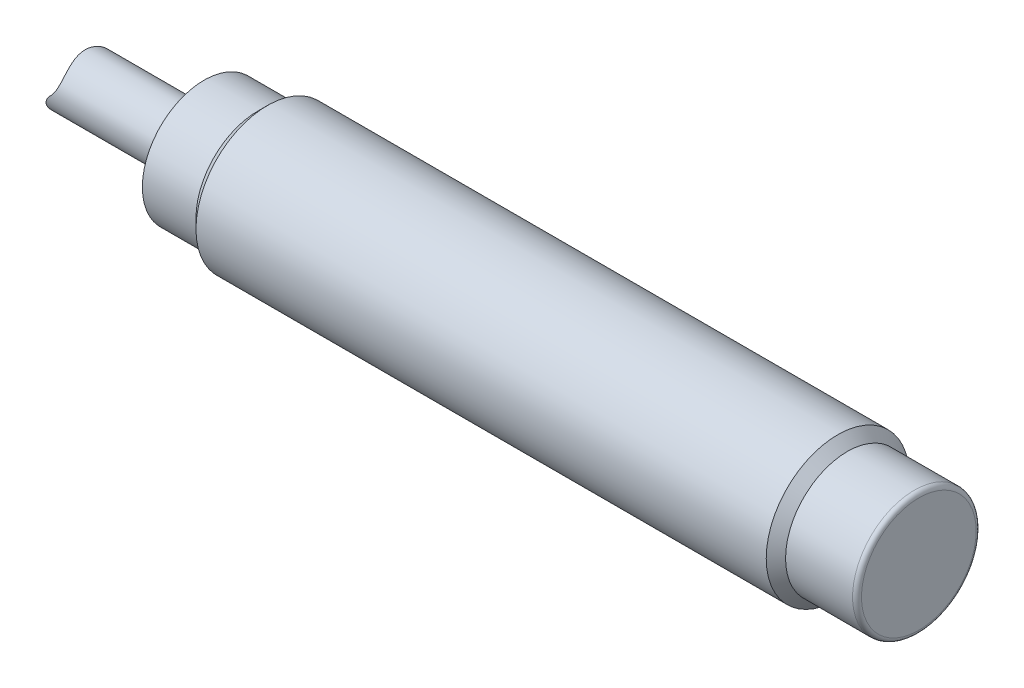
ISO-10303-21;
HEADER;
FILE_DESCRIPTION(('STEP AP214'),'2;1');
FILE_NAME('part.step','',(''),(''),'','','');
FILE_SCHEMA(('AUTOMOTIVE_DESIGN { 1 0 10303 214 1 1 1 1 }'));
ENDSEC;
DATA;
#1=APPLICATION_CONTEXT('core data for automotive mechanical design processes');
#2=APPLICATION_PROTOCOL_DEFINITION('international standard','automotive_design',2000,#1);
#3=PRODUCT_CONTEXT('',#1,'mechanical');
#4=PRODUCT('Part','Part','',(#3));
#5=PRODUCT_RELATED_PRODUCT_CATEGORY('part','',(#4));
#6=PRODUCT_DEFINITION_FORMATION('','',#4);
#7=PRODUCT_DEFINITION_CONTEXT('part definition',#1,'design');
#8=PRODUCT_DEFINITION('design','',#6,#7);
#9=PRODUCT_DEFINITION_SHAPE('','',#8);
#10=(LENGTH_UNIT() NAMED_UNIT(*) SI_UNIT(.MILLI.,.METRE.));
#11=(NAMED_UNIT(*) PLANE_ANGLE_UNIT() SI_UNIT($,.RADIAN.));
#12=(NAMED_UNIT(*) SI_UNIT($,.STERADIAN.) SOLID_ANGLE_UNIT());
#13=UNCERTAINTY_MEASURE_WITH_UNIT(LENGTH_MEASURE(1.E-05),#10,'distance_accuracy_value','');
#14=(GEOMETRIC_REPRESENTATION_CONTEXT(3) GLOBAL_UNCERTAINTY_ASSIGNED_CONTEXT((#13)) GLOBAL_UNIT_ASSIGNED_CONTEXT((#10,
#11,#12)) REPRESENTATION_CONTEXT('',''));
#15=CARTESIAN_POINT('',(0.,0.,0.));
#16=DIRECTION('',(0.,0.,1.));
#17=DIRECTION('',(1.,0.,0.));
#18=AXIS2_PLACEMENT_3D('',#15,#16,#17);
#19=CARTESIAN_POINT('',(0.,3.45875,0.));
#20=DIRECTION('',(1.,0.,0.));
#21=DIRECTION('',(0.,0.,-1.));
#22=AXIS2_PLACEMENT_3D('',#19,#20,#21);
#23=PLANE('',#22);
#24=CARTESIAN_POINT('',(0.,2.5,0.));
#25=DIRECTION('',(1.,0.,0.));
#26=DIRECTION('',(0.,0.,-1.));
#27=AXIS2_PLACEMENT_3D('',#24,#25,#26);
#28=CIRCLE('',#27,0.5);
#29=CARTESIAN_POINT('',(0.,2.5,-0.5));
#30=VERTEX_POINT('',#29);
#31=EDGE_CURVE('E19',#30,#30,#28,.T.);
#32=ORIENTED_EDGE('',*,*,#31,.T.);
#33=EDGE_LOOP('',(#32));
#34=FACE_BOUND('',#33,.T.);
#35=CARTESIAN_POINT('',(0.,0.,0.));
#36=DIRECTION('',(1.,0.,0.));
#37=DIRECTION('',(0.,0.,-1.));
#38=AXIS2_PLACEMENT_3D('',#35,#36,#37);
#39=CIRCLE('',#38,1.6);
#40=CARTESIAN_POINT('',(0.,0.,-1.6));
#41=VERTEX_POINT('',#40);
#42=EDGE_CURVE('E49',#41,#41,#39,.T.);
#43=ORIENTED_EDGE('',*,*,#42,.T.);
#44=EDGE_LOOP('',(#43));
#45=FACE_BOUND('',#44,.T.);
#46=CARTESIAN_POINT('',(0.,0.,0.));
#47=DIRECTION('',(-1.,0.,0.));
#48=DIRECTION('',(0.,0.,1.));
#49=AXIS2_PLACEMENT_3D('',#46,#47,#48);
#50=CIRCLE('',#49,3.45875);
#51=CARTESIAN_POINT('',(0.,0.,3.45875));
#52=VERTEX_POINT('',#51);
#53=EDGE_CURVE('E97',#52,#52,#50,.T.);
#54=ORIENTED_EDGE('',*,*,#53,.T.);
#55=EDGE_LOOP('',(#54));
#56=FACE_BOUND('',#55,.T.);
#57=ADVANCED_FACE('F16',(#34,#45,#56),#23,.F.);
#58=CARTESIAN_POINT('',(36.,0.,0.));
#59=DIRECTION('',(-1.,0.,0.));
#60=DIRECTION('',(0.,0.,1.));
#61=AXIS2_PLACEMENT_3D('',#58,#59,#60);
#62=CONICAL_SURFACE('',#61,3.45875,0.785398163397452);
#63=CARTESIAN_POINT('',(35.45875,0.,0.));
#64=DIRECTION('',(-1.,0.,0.));
#65=DIRECTION('',(0.,0.,1.));
#66=AXIS2_PLACEMENT_3D('',#63,#64,#65);
#67=CIRCLE('',#66,4.);
#68=CARTESIAN_POINT('',(35.45875,0.,4.));
#69=VERTEX_POINT('',#68);
#70=EDGE_CURVE('E11',#69,#69,#67,.T.);
#71=ORIENTED_EDGE('',*,*,#70,.F.);
#72=EDGE_LOOP('',(#71));
#73=FACE_BOUND('',#72,.T.);
#74=CARTESIAN_POINT('',(36.,0.,0.));
#75=DIRECTION('',(-1.,0.,0.));
#76=DIRECTION('',(0.,0.,1.));
#77=AXIS2_PLACEMENT_3D('',#74,#75,#76);
#78=CIRCLE('',#77,3.45875);
#79=CARTESIAN_POINT('',(36.,0.,3.45875));
#80=VERTEX_POINT('',#79);
#81=EDGE_CURVE('E101',#80,#80,#78,.T.);
#82=ORIENTED_EDGE('',*,*,#81,.T.);
#83=EDGE_LOOP('',(#82));
#84=FACE_BOUND('',#83,.T.);
#85=ADVANCED_FACE('F84',(#73,#84),#62,.T.);
#86=CARTESIAN_POINT('',(0.,0.,0.));
#87=DIRECTION('',(-1.,0.,0.));
#88=DIRECTION('',(0.,0.,1.));
#89=AXIS2_PLACEMENT_3D('',#86,#87,#88);
#90=CYLINDRICAL_SURFACE('',#89,4.);
#91=CARTESIAN_POINT('',(3.54125,0.,0.));
#92=DIRECTION('',(-1.,0.,0.));
#93=DIRECTION('',(0.,0.,1.));
#94=AXIS2_PLACEMENT_3D('',#91,#92,#93);
#95=CIRCLE('',#94,4.);
#96=CARTESIAN_POINT('',(3.54125,0.,4.));
#97=VERTEX_POINT('',#96);
#98=EDGE_CURVE('E25',#97,#97,#95,.T.);
#99=ORIENTED_EDGE('',*,*,#98,.F.);
#100=EDGE_LOOP('',(#99));
#101=FACE_BOUND('',#100,.T.);
#102=ORIENTED_EDGE('',*,*,#70,.T.);
#103=EDGE_LOOP('',(#102));
#104=FACE_BOUND('',#103,.T.);
#105=ADVANCED_FACE('F89',(#101,#104),#90,.T.);
#106=CARTESIAN_POINT('',(3.54125,0.,0.));
#107=DIRECTION('',(1.,0.,0.));
#108=DIRECTION('',(0.,0.,-1.));
#109=AXIS2_PLACEMENT_3D('',#106,#107,#108);
#110=CONICAL_SURFACE('',#109,4.,0.785398163397446);
#111=CARTESIAN_POINT('',(3.,0.,0.));
#112=DIRECTION('',(-1.,0.,0.));
#113=DIRECTION('',(0.,0.,1.));
#114=AXIS2_PLACEMENT_3D('',#111,#112,#113);
#115=CIRCLE('',#114,3.45875);
#116=CARTESIAN_POINT('',(3.,0.,3.45875));
#117=VERTEX_POINT('',#116);
#118=EDGE_CURVE('E100',#117,#117,#115,.T.);
#119=ORIENTED_EDGE('',*,*,#118,.F.);
#120=EDGE_LOOP('',(#119));
#121=FACE_BOUND('',#120,.T.);
#122=ORIENTED_EDGE('',*,*,#98,.T.);
#123=EDGE_LOOP('',(#122));
#124=FACE_BOUND('',#123,.T.);
#125=ADVANCED_FACE('F117',(#121,#124),#110,.T.);
#126=CARTESIAN_POINT('',(0.,0.,0.));
#127=DIRECTION('',(-1.,0.,0.));
#128=DIRECTION('',(0.,0.,1.));
#129=AXIS2_PLACEMENT_3D('',#126,#127,#128);
#130=CYLINDRICAL_SURFACE('',#129,3.45875);
#131=ORIENTED_EDGE('',*,*,#53,.F.);
#132=EDGE_LOOP('',(#131));
#133=FACE_BOUND('',#132,.T.);
#134=ORIENTED_EDGE('',*,*,#118,.T.);
#135=EDGE_LOOP('',(#134));
#136=FACE_BOUND('',#135,.T.);
#137=ADVANCED_FACE('F129',(#133,#136),#130,.T.);
#138=CARTESIAN_POINT('',(35.,0.,0.));
#139=DIRECTION('',(1.,0.,0.));
#140=DIRECTION('',(0.,-1.,0.));
#141=AXIS2_PLACEMENT_3D('',#138,#139,#140);
#142=CYLINDRICAL_SURFACE('',#141,3.45875);
#143=CARTESIAN_POINT('',(39.75,0.,0.));
#144=DIRECTION('',(-1.,0.,0.));
#145=DIRECTION('',(0.,0.,-1.));
#146=AXIS2_PLACEMENT_3D('',#143,#144,#145);
#147=CIRCLE('',#146,3.45875);
#148=CARTESIAN_POINT('',(39.75,0.,-3.45875));
#149=VERTEX_POINT('',#148);
#150=EDGE_CURVE('E109',#149,#149,#147,.T.);
#151=ORIENTED_EDGE('',*,*,#150,.T.);
#152=EDGE_LOOP('',(#151));
#153=FACE_BOUND('',#152,.T.);
#154=ORIENTED_EDGE('',*,*,#81,.F.);
#155=EDGE_LOOP('',(#154));
#156=FACE_BOUND('',#155,.T.);
#157=ADVANCED_FACE('F126',(#153,#156),#142,.T.);
#158=CARTESIAN_POINT('',(39.75,0.,0.));
#159=DIRECTION('',(-1.,0.,0.));
#160=DIRECTION('',(0.,0.,-1.));
#161=AXIS2_PLACEMENT_3D('',#158,#159,#160);
#162=TOROIDAL_SURFACE('',#161,3.20875,0.25);
#163=CARTESIAN_POINT('',(40.,0.,0.));
#164=DIRECTION('',(-1.,0.,0.));
#165=DIRECTION('',(0.,0.,-1.));
#166=AXIS2_PLACEMENT_3D('',#163,#164,#165);
#167=CIRCLE('',#166,3.20875);
#168=CARTESIAN_POINT('',(40.,0.,-3.20875));
#169=VERTEX_POINT('',#168);
#170=EDGE_CURVE('E56',#169,#169,#167,.T.);
#171=ORIENTED_EDGE('',*,*,#170,.T.);
#172=EDGE_LOOP('',(#171));
#173=FACE_BOUND('',#172,.T.);
#174=ORIENTED_EDGE('',*,*,#150,.F.);
#175=EDGE_LOOP('',(#174));
#176=FACE_BOUND('',#175,.T.);
#177=ADVANCED_FACE('F128',(#173,#176),#162,.T.);
#178=CARTESIAN_POINT('',(40.,0.,0.));
#179=DIRECTION('',(1.,0.,0.));
#180=DIRECTION('',(0.,0.,-1.));
#181=AXIS2_PLACEMENT_3D('',#178,#179,#180);
#182=PLANE('',#181);
#183=ORIENTED_EDGE('',*,*,#170,.F.);
#184=EDGE_LOOP('',(#183));
#185=FACE_BOUND('',#184,.T.);
#186=ADVANCED_FACE('F136',(#185),#182,.T.);
#187=CARTESIAN_POINT('',(1.,0.,0.));
#188=DIRECTION('',(-1.,0.,0.));
#189=DIRECTION('',(0.,1.,0.));
#190=AXIS2_PLACEMENT_3D('',#187,#188,#189);
#191=CYLINDRICAL_SURFACE('',#190,1.6);
#192=CARTESIAN_POINT('',(-7.43933982822018,-1.06066017177982,1.19791485507109));
#193=CARTESIAN_POINT('',(-7.43933826152804,-1.00940458658936,1.24329412354344));
#194=CARTESIAN_POINT('',(-7.4367057391357,-0.955198339626685,1.28539939310043));
#195=CARTESIAN_POINT('',(-7.42445109612747,-0.842347578229319,1.3620198547443));
#196=CARTESIAN_POINT('',(-7.41482958743262,-0.783703452755969,1.39653571097802));
#197=CARTESIAN_POINT('',(-7.38720250925252,-0.663813862398271,1.45735525918702));
#198=CARTESIAN_POINT('',(-7.3691624149065,-0.602558638263161,1.48362438192793));
#199=CARTESIAN_POINT('',(-7.32405247424704,-0.480305435018354,1.52758889483195));
#200=CARTESIAN_POINT('',(-7.29698425029191,-0.419307411682451,1.5452858240213));
#201=CARTESIAN_POINT('',(-7.2357203962433,-0.303383698101435,1.57204112648688));
#202=CARTESIAN_POINT('',(-7.20198386291264,-0.248307743489322,1.58151121434178));
#203=CARTESIAN_POINT('',(-7.1272983720701,-0.142536652540528,1.59453045190826));
#204=CARTESIAN_POINT('',(-7.08634690606939,-0.0918430490280481,1.59807753780078));
#205=CARTESIAN_POINT('',(-6.99516052345592,0.0070809452636938,1.60080138827623));
#206=CARTESIAN_POINT('',(-6.94448431497035,0.0549109961640043,1.59966538193553));
#207=CARTESIAN_POINT('',(-6.83710123311178,0.143024829243827,1.59420709729684));
#208=CARTESIAN_POINT('',(-6.78039062596464,0.183303896200008,1.58988283634631));
#209=CARTESIAN_POINT('',(-6.65326491356203,0.260946694184288,1.57913463319934));
#210=CARTESIAN_POINT('',(-6.58206341509788,0.296998209724641,1.57249474121177));
#211=CARTESIAN_POINT('',(-6.43479055136118,0.357390228565433,1.55988067906965));
#212=CARTESIAN_POINT('',(-6.3587180822695,0.381728066691273,1.55390666065648));
#213=CARTESIAN_POINT('',(-6.19878025935329,0.419147268629681,1.54425426762211));
#214=CARTESIAN_POINT('',(-6.11472201423874,0.431457192135053,1.54073693089648));
#215=CARTESIAN_POINT('',(-5.94567949864171,0.441713601045368,1.53782974279124));
#216=CARTESIAN_POINT('',(-5.86069549727463,0.439664155007564,1.5384387222672));
#217=CARTESIAN_POINT('',(-5.69551117786904,0.421635229899637,1.54347043147627));
#218=CARTESIAN_POINT('',(-5.61524961981969,0.406168351364165,1.54775275780927));
#219=CARTESIAN_POINT('',(-5.45840889546646,0.362483790637917,1.55855918548484));
#220=CARTESIAN_POINT('',(-5.38183165103129,0.334259531850267,1.56508444267158));
#221=CARTESIAN_POINT('',(-5.23246597386016,0.264960876929348,1.57831108115229));
#222=CARTESIAN_POINT('',(-5.1598139120908,0.223592289571169,1.58501290627042));
#223=CARTESIAN_POINT('',(-5.02220545839892,0.129222341636535,1.59547791176428));
#224=CARTESIAN_POINT('',(-4.95724971468124,0.0762200023046719,1.59924084476753));
#225=CARTESIAN_POINT('',(-4.83737152986209,-0.039601305173358,1.60054965982077));
#226=CARTESIAN_POINT('',(-4.78238895149016,-0.102356887095543,1.59813422901045));
#227=CARTESIAN_POINT('',(-4.68403269771495,-0.235424443444145,1.58398831376278));
#228=CARTESIAN_POINT('',(-4.64063840178013,-0.305722679421835,1.5722745247078));
#229=CARTESIAN_POINT('',(-4.57208990245262,-0.439795221682153,1.53968851339714));
#230=CARTESIAN_POINT('',(-4.54521671537346,-0.503069513734583,1.52036124658226));
#231=CARTESIAN_POINT('',(-4.50108723945649,-0.629490046602858,1.47251510333415));
#232=CARTESIAN_POINT('',(-4.48382901609023,-0.692636310628613,1.44399807770207));
#233=CARTESIAN_POINT('',(-4.45917372702416,-0.810762671938082,1.38086015969797));
#234=CARTESIAN_POINT('',(-4.45107034483247,-0.865983253662054,1.34695282222136));
#235=CARTESIAN_POINT('',(-4.44099654373601,-0.972239618679858,1.27238615415697));
#236=CARTESIAN_POINT('',(-4.43902761726155,-1.02327438068026,1.2317251830352));
#237=CARTESIAN_POINT('',(-4.43976580150505,-1.12458848824646,1.14034650549909));
#238=CARTESIAN_POINT('',(-4.44293784771848,-1.17432937484256,1.08903903038393));
#239=CARTESIAN_POINT('',(-4.45279444980379,-1.26640458795957,0.980457946530844));
#240=CARTESIAN_POINT('',(-4.45948171410951,-1.30873316981551,0.923179764753623));
#241=CARTESIAN_POINT('',(-4.47572456233814,-1.39225513887711,0.792869364316814));
#242=CARTESIAN_POINT('',(-4.48557986377707,-1.43186963185986,0.718858158928312));
#243=CARTESIAN_POINT('',(-4.50441921898918,-1.49909542098784,0.565448604265602));
#244=CARTESIAN_POINT('',(-4.51340298950695,-1.52670282480768,0.486048517711881));
#245=CARTESIAN_POINT('',(-4.52855096050889,-1.57083074360626,0.317273357685544));
#246=CARTESIAN_POINT('',(-4.53444376120227,-1.58633013218796,0.227601528811655));
#247=CARTESIAN_POINT('',(-4.54035753227292,-1.60188576223562,0.0467694245743247));
#248=CARTESIAN_POINT('',(-4.54038217081772,-1.60195165112751,-0.0443898853249502));
#249=CARTESIAN_POINT('',(-4.53475893166134,-1.58715771123615,-0.219453308391951));
#250=CARTESIAN_POINT('',(-4.52946969771281,-1.57324155385672,-0.303451657670416));
#251=CARTESIAN_POINT('',(-4.51528492827796,-1.53239018214424,-0.467944175774894));
#252=CARTESIAN_POINT('',(-4.50638640638351,-1.50544418306264,-0.548435381483725));
#253=CARTESIAN_POINT('',(-4.48721488093757,-1.43826513794809,-0.706388200554219));
#254=CARTESIAN_POINT('',(-4.47690855529677,-1.39765639349813,-0.783685581444942));
#255=CARTESIAN_POINT('',(-4.45849147721052,-1.30427144398297,-0.930836501510955));
#256=CARTESIAN_POINT('',(-4.45037952875664,-1.25150189612311,-1.00069408298408));
#257=CARTESIAN_POINT('',(-4.44079756895804,-1.14350131344641,-1.12159771990635));
#258=CARTESIAN_POINT('',(-4.43853106130201,-1.08975318623241,-1.17390128950112));
#259=CARTESIAN_POINT('',(-4.44067216805859,-0.975520927903866,-1.27040696776533));
#260=CARTESIAN_POINT('',(-4.44507396123134,-0.915042714657622,-1.31461610489531));
#261=CARTESIAN_POINT('',(-4.46277969442849,-0.788913329262331,-1.39398759329789));
#262=CARTESIAN_POINT('',(-4.47614836186659,-0.723227628895435,-1.42908157310501));
#263=CARTESIAN_POINT('',(-4.51337260493792,-0.590155783231023,-1.48896983521561));
#264=CARTESIAN_POINT('',(-4.53722152326848,-0.522770742966743,-1.51377063657387));
#265=CARTESIAN_POINT('',(-4.59213314903929,-0.398012742699075,-1.55090324645187));
#266=CARTESIAN_POINT('',(-4.62194937385869,-0.340426951069605,-1.56439273873309));
#267=CARTESIAN_POINT('',(-4.68944010667613,-0.228791220297659,-1.58457386641172));
#268=CARTESIAN_POINT('',(-4.72711628807651,-0.174742037331291,-1.59126405243782));
#269=CARTESIAN_POINT('',(-4.81031658757534,-0.0707943191541706,-1.59930224329919));
#270=CARTESIAN_POINT('',(-4.85598785672546,-0.0210057195950814,-1.60053604459742));
#271=CARTESIAN_POINT('',(-4.95356665397159,0.0719471322406653,-1.59905845737461));
#272=CARTESIAN_POINT('',(-5.00547715293264,0.115108206306488,-1.59634518253615));
#273=CARTESIAN_POINT('',(-5.12229295800543,0.199635346841902,-1.5881436848455));
#274=CARTESIAN_POINT('',(-5.18799573081007,0.239867734091843,-1.58231492237465));
#275=CARTESIAN_POINT('',(-5.32475492615987,0.309811356137842,-1.5701211041989));
#276=CARTESIAN_POINT('',(-5.39581420031488,0.339516938178503,-1.56375576262213));
#277=CARTESIAN_POINT('',(-5.54888711603396,0.390081669097548,-1.55196139966506));
#278=CARTESIAN_POINT('',(-5.63129405445072,0.409799723999367,-1.54668361164872));
#279=CARTESIAN_POINT('',(-5.79838181927559,0.435088894392121,-1.53976470606346));
#280=CARTESIAN_POINT('',(-5.88306174259229,0.440665546799111,-1.53812216518416));
#281=CARTESIAN_POINT('',(-6.0498681088947,0.437524387251483,-1.53901654000837));
#282=CARTESIAN_POINT('',(-6.1320025145124,0.429183176226907,-1.54144335257082));
#283=CARTESIAN_POINT('',(-6.29365935180756,0.39921010450287,-1.54947310840639));
#284=CARTESIAN_POINT('',(-6.3731808314582,0.377573454921125,-1.55507719604552));
#285=CARTESIAN_POINT('',(-6.52768453801681,0.321591339137555,-1.56760891845159));
#286=CARTESIAN_POINT('',(-6.60265667654907,0.287218748788715,-1.57453936266084));
#287=CARTESIAN_POINT('',(-6.74609192893047,0.206589448551566,-1.58713004951472));
#288=CARTESIAN_POINT('',(-6.8145520711992,0.160327348501049,-1.59278971385941));
#289=CARTESIAN_POINT('',(-6.94469520926573,0.055758812561432,-1.59990635679674));
#290=CARTESIAN_POINT('',(-7.00617210808067,-0.00281393947620018,-1.60125743086425));
#291=CARTESIAN_POINT('',(-7.11818572109972,-0.129303138893051,-1.59601408566719));
#292=CARTESIAN_POINT('',(-7.16873930431885,-0.197204910161393,-1.58943202257464));
#293=CARTESIAN_POINT('',(-7.25188136360926,-0.330807504341753,-1.56671670409161));
#294=CARTESIAN_POINT('',(-7.28588132750122,-0.395832752877863,-1.55179393599143));
#295=CARTESIAN_POINT('',(-7.34323521642542,-0.527532273988252,-1.51209200342484));
#296=CARTESIAN_POINT('',(-7.36659660647799,-0.594205355547151,-1.48731977319744));
#297=CARTESIAN_POINT('',(-7.4008582904377,-0.717768226385523,-1.43137839999359));
#298=CARTESIAN_POINT('',(-7.41292841544271,-0.774861801898345,-1.40135341108432));
#299=CARTESIAN_POINT('',(-7.43015850226499,-0.885709592710868,-1.33406294551772));
#300=CARTESIAN_POINT('',(-7.43531676984747,-0.939462986186949,-1.29679569619955));
#301=CARTESIAN_POINT('',(-7.44022724039268,-1.04470344670121,-1.2138007928079));
#302=CARTESIAN_POINT('',(-7.43969418851224,-1.09594015525155,-1.16774164818204));
#303=CARTESIAN_POINT('',(-7.43435719368311,-1.19195819039327,-1.06956055959266));
#304=CARTESIAN_POINT('',(-7.4295508894631,-1.23673593205161,-1.01743527750508));
#305=CARTESIAN_POINT('',(-7.41644479084801,-1.32627250753592,-0.898583442626713));
#306=CARTESIAN_POINT('',(-7.40768405112395,-1.36968435865905,-0.83089171760395));
#307=CARTESIAN_POINT('',(-7.38955900179567,-1.44588933588103,-0.689813639824027));
#308=CARTESIAN_POINT('',(-7.38019423579473,-1.47867431700142,-0.616422972254742));
#309=CARTESIAN_POINT('',(-7.3622925460462,-1.53630346820972,-0.455959984008677));
#310=CARTESIAN_POINT('',(-7.35400146324213,-1.55966297920126,-0.368318443596823));
#311=CARTESIAN_POINT('',(-7.34247048812418,-1.5912429916325,-0.190064561846963));
#312=CARTESIAN_POINT('',(-7.33922642140789,-1.59947600526544,-0.0994547389956715));
#313=CARTESIAN_POINT('',(-7.33884690722223,-1.60045247006751,0.0776603466172593));
#314=CARTESIAN_POINT('',(-7.3414361815252,-1.59389392630022,0.164161850370508));
#315=CARTESIAN_POINT('',(-7.35137622528442,-1.56697288166325,0.334758017055878));
#316=CARTESIAN_POINT('',(-7.35873117760712,-1.54659825359531,0.418850497802394));
#317=CARTESIAN_POINT('',(-7.37597709963092,-1.49292722322583,0.581791859926587));
#318=CARTESIAN_POINT('',(-7.38584907728246,-1.45972667158278,0.660674670627386));
#319=CARTESIAN_POINT('',(-7.40524586673581,-1.3812027409143,0.812118630085492));
#320=CARTESIAN_POINT('',(-7.41477110951307,-1.33589503886753,0.884687794139757));
#321=CARTESIAN_POINT('',(-7.42744992936294,-1.25206646991709,0.997692996105048));
#322=CARTESIAN_POINT('',(-7.43166595141939,-1.21678273266296,1.0404389976483));
#323=CARTESIAN_POINT('',(-7.43761148423107,-1.14186633878649,1.12214615856292));
#324=CARTESIAN_POINT('',(-7.43934109897295,-1.10223386411188,1.16110747615399));
#325=CARTESIAN_POINT('',(-7.43933982822018,-1.06066017177982,1.19791485507109));
#326=B_SPLINE_CURVE_WITH_KNOTS('',3,(#192,#193,#194,#195,#196,#197,#198,#199,#200,#201,#202,
#203,#204,#205,#206,#207,#208,#209,#210,#211,#212,#213,#214,#215,#216,#217,#218,#219,#220,#221,
#222,#223,#224,#225,#226,#227,#228,#229,#230,#231,#232,#233,#234,#235,#236,#237,#238,#239,#240,
#241,#242,#243,#244,#245,#246,#247,#248,#249,#250,#251,#252,#253,#254,#255,#256,#257,#258,#259,
#260,#261,#262,#263,#264,#265,#266,#267,#268,#269,#270,#271,#272,#273,#274,#275,#276,#277,#278,
#279,#280,#281,#282,#283,#284,#285,#286,#287,#288,#289,#290,#291,#292,#293,#294,#295,#296,#297,
#298,#299,#300,#301,#302,#303,#304,#305,#306,#307,#308,#309,#310,#311,#312,#313,#314,#315,#316,
#317,#318,#319,#320,#321,#322,#323,#324,#325),.UNSPECIFIED.,.T.,.F.,(4,2,2,2,2,2,2,2,2,2,2,2,2,
2,2,2,2,2,2,2,2,2,2,2,2,2,2,2,2,2,2,2,2,2,2,2,2,2,2,2,2,2,2,2,2,2,2,2,2,2,2,2,2,2,2,2,2,2,2,2,2,
2,2,2,2,2,4),(0.,0.205206681687893,0.410395398659595,0.616433096770201,0.822433789759176,
1.0174071880867,1.21244850905124,1.42071997369007,1.62912106367323,1.86834406326852,
2.10762146678737,2.36139774462166,2.61510212086235,2.8595206291787,3.10406528240256,
3.35452253241003,3.60500086163697,3.85391461224791,4.10238244157574,4.3154035366674,
4.52838175647204,4.72347735318013,4.91862041030955,5.13241572985873,5.34637601813807,
5.59888981916539,5.8514854164226,6.12359263038852,6.39552975064561,6.65026897445898,
6.90521940676696,7.16784759879809,7.43033236001323,7.65451352117462,7.87849909120513,
8.10411915558507,8.3295961074807,8.52736738955554,8.72518082062773,8.92711551860137,
9.12914675337439,9.35998823027107,9.59095347882229,9.84437750687392,10.0977022941057,
10.3442829594396,10.5909524927343,10.8381504143473,11.0854606025386,11.3388045770578,
11.5917544678095,11.8150431871202,12.0381749838014,12.234174072415,12.4302211955505,
12.6361387172832,12.8421700936398,13.0838921326153,13.3257990040747,13.5976405321906,
13.8692570995894,14.1283257164277,14.3876220280462,14.6450169259809,14.9020801369624,
15.0685313877837,15.2349756770699),.UNSPECIFIED.);
#327=CARTESIAN_POINT('',(-7.,0.,-1.6));
#328=VERTEX_POINT('',#327);
#329=CARTESIAN_POINT('',(-7.,0.,1.6));
#330=VERTEX_POINT('',#329);
#331=EDGE_CURVE('E40',#328,#330,#326,.T.);
#332=ORIENTED_EDGE('',*,*,#331,.F.);
#333=CARTESIAN_POINT('',(-8.,-0.438112774186192,-1.53884930941756));
#334=CARTESIAN_POINT('',(-7.95806330824139,-0.436420231483032,-1.53931826061967));
#335=CARTESIAN_POINT('',(-7.91621001550425,-0.432958646077223,-1.54031344548903));
#336=CARTESIAN_POINT('',(-7.83298433371861,-0.422551917072433,-1.54320754177099));
#337=CARTESIAN_POINT('',(-7.79161178386129,-0.415607974777167,-1.54510614152229));
#338=CARTESIAN_POINT('',(-7.70968438381962,-0.398300807810633,-1.54965596579749));
#339=CARTESIAN_POINT('',(-7.66912856257514,-0.387941933506639,-1.55230623215764));
#340=CARTESIAN_POINT('',(-7.5890649196696,-0.363891394698232,-1.55811924482391));
#341=CARTESIAN_POINT('',(-7.54955716960615,-0.350199503149993,-1.56128202603743));
#342=CARTESIAN_POINT('',(-7.43303905737995,-0.304274337577282,-1.57111589407585));
#343=CARTESIAN_POINT('',(-7.35791448706635,-0.267166195307477,-1.57814060067616));
#344=CARTESIAN_POINT('',(-7.21475256093419,-0.180885559775622,-1.59033689272348));
#345=CARTESIAN_POINT('',(-7.14671875947005,-0.131707057106221,-1.59550755194028));
#346=CARTESIAN_POINT('',(-7.01935507763211,-0.0222772257203611,-1.60078543629985));
#347=CARTESIAN_POINT('',(-6.96006530293381,0.0380224329017684,-1.6008700125062));
#348=CARTESIAN_POINT('',(-6.85274010523573,0.16737544553517,-1.59253127841601));
#349=CARTESIAN_POINT('',(-6.80468493323059,0.236413104777817,-1.58412303802298));
#350=CARTESIAN_POINT('',(-6.72686501305407,0.370575750861898,-1.55779558830184));
#351=CARTESIAN_POINT('',(-6.69554356716452,0.435063834680584,-1.54123713634206));
#352=CARTESIAN_POINT('',(-6.64318951249953,0.565003582451459,-1.4984775169604));
#353=CARTESIAN_POINT('',(-6.62215210427957,0.630454782209029,-1.47228085760493));
#354=CARTESIAN_POINT('',(-6.59155809691261,0.752047324614525,-1.41367584233148));
#355=CARTESIAN_POINT('',(-6.58099715989062,0.808423734193379,-1.38226078657688));
#356=CARTESIAN_POINT('',(-6.56649101636849,0.917520528858623,-1.31238509028835));
#357=CARTESIAN_POINT('',(-6.56254732733288,0.970240072697652,-1.27392283593617));
#358=CARTESIAN_POINT('',(-6.55976064931085,1.07402928761055,-1.1879834375569));
#359=CARTESIAN_POINT('',(-6.56128009859973,1.1247471202007,-1.14007291504712));
#360=CARTESIAN_POINT('',(-6.56832652182238,1.21939379019654,-1.03822995718258));
#361=CARTESIAN_POINT('',(-6.57385604157293,1.26331829331428,-0.984293714774438));
#362=CARTESIAN_POINT('',(-6.58821288217957,1.35083467430996,-0.861337452420707));
#363=CARTESIAN_POINT('',(-6.59745105593029,1.39298709784953,-0.791338504028702));
#364=CARTESIAN_POINT('',(-6.61602031890954,1.46617766625726,-0.645733818884799));
#365=CARTESIAN_POINT('',(-6.62535146273092,1.49720883048057,-0.570124596458361));
#366=CARTESIAN_POINT('',(-6.64247529337564,1.5501703324216,-0.406377112718517));
#367=CARTESIAN_POINT('',(-6.64999307484284,1.57075621785181,-0.317767528706169));
#368=CARTESIAN_POINT('',(-6.65960324666254,1.59660810568975,-0.1380868961063));
#369=CARTESIAN_POINT('',(-6.66169966079923,1.60188547056386,-0.0470177238041312));
#370=CARTESIAN_POINT('',(-6.65984517634011,1.5970517058287,0.129632046142236));
#371=CARTESIAN_POINT('',(-6.65621906998505,1.58776724142332,0.21524016850103));
#372=CARTESIAN_POINT('',(-6.64460256662293,1.5557013486328,0.383596396583027));
#373=CARTESIAN_POINT('',(-6.63660987430544,1.53291282125814,0.46634297378034));
#374=CARTESIAN_POINT('',(-6.61851587284536,1.47436941129969,0.627390920471568));
#375=CARTESIAN_POINT('',(-6.60840273006494,1.43854089350028,0.705664065512417));
#376=CARTESIAN_POINT('',(-6.58914093303767,1.35473921539,0.855613056700447));
#377=CARTESIAN_POINT('',(-6.57999303068429,1.30675668496731,0.927283754302395));
#378=CARTESIAN_POINT('',(-6.56576876174415,1.19673842046699,1.06583660756908));
#379=CARTESIAN_POINT('',(-6.56092799253788,1.13410321529964,1.13227805222931));
#380=CARTESIAN_POINT('',(-6.56054243382614,1.0324694384032,1.22314362615496));
#381=CARTESIAN_POINT('',(-6.56155776868622,0.997329564585884,1.25195463932741));
#382=CARTESIAN_POINT('',(-6.56637868409175,0.924860462661494,1.30640137598157));
#383=CARTESIAN_POINT('',(-6.57018303424378,0.887532206653153,1.33203849382159));
#384=CARTESIAN_POINT('',(-6.58352025317458,0.793847371899125,1.39071215532895));
#385=CARTESIAN_POINT('',(-6.59486655579972,0.736525244258556,1.42184589400285));
#386=CARTESIAN_POINT('',(-6.62549049137842,0.620326680797462,1.47624879965261));
#387=CARTESIAN_POINT('',(-6.64476320210436,0.561451230772911,1.4995228311298));
#388=CARTESIAN_POINT('',(-6.69163770336339,0.444421345279925,1.53827577360487));
#389=CARTESIAN_POINT('',(-6.71924333657294,0.386267255370694,1.55375107946009));
#390=CARTESIAN_POINT('',(-6.78248542129387,0.272951885224606,1.57761126472057));
#391=CARTESIAN_POINT('',(-6.81812529123885,0.217791891357741,1.58599311874223));
#392=CARTESIAN_POINT('',(-6.8969850076829,0.111838296807629,1.5969841408241));
#393=CARTESIAN_POINT('',(-6.94026848042968,0.0610871483470074,1.59954213050658));
#394=CARTESIAN_POINT('',(-7.03320615717068,-0.0342258826256169,1.60034512942393));
#395=CARTESIAN_POINT('',(-7.08286334819552,-0.0787848426579512,1.59858810939205));
#396=CARTESIAN_POINT('',(-7.19458948150098,-0.166375999268706,1.59201174870068));
#397=CARTESIAN_POINT('',(-7.25742933003584,-0.208394450461055,1.58681186788659));
#398=CARTESIAN_POINT('',(-7.38865827857166,-0.282504258126453,1.57531059363751));
#399=CARTESIAN_POINT('',(-7.45704918868951,-0.314592359914441,1.56900884011913));
#400=CARTESIAN_POINT('',(-7.56509926337056,-0.355689342636909,1.56003102536444));
#401=CARTESIAN_POINT('',(-7.60332974132605,-0.368491593509882,1.55703168589478));
#402=CARTESIAN_POINT('',(-7.68073934168129,-0.390988355681638,1.55153554161157));
#403=CARTESIAN_POINT('',(-7.71991846536858,-0.400682862762232,1.5490387374801));
#404=CARTESIAN_POINT('',(-7.79901777738321,-0.41689682538052,1.54475560925048));
#405=CARTESIAN_POINT('',(-7.83893884112483,-0.423412245660223,1.54297018864529));
#406=CARTESIAN_POINT('',(-7.91921423174231,-0.433204538267877,1.54024366852394));
#407=CARTESIAN_POINT('',(-7.95956866384812,-0.436480605184704,1.53930277899169));
#408=CARTESIAN_POINT('',(-8.,-0.438112774186192,1.53884930941756));
#409=B_SPLINE_CURVE_WITH_KNOTS('',3,(#333,#334,#335,#336,#337,#338,#339,#340,#341,#342,#343,
#344,#345,#346,#347,#348,#349,#350,#351,#352,#353,#354,#355,#356,#357,#358,#359,#360,#361,#362,
#363,#364,#365,#366,#367,#368,#369,#370,#371,#372,#373,#374,#375,#376,#377,#378,#379,#380,#381,
#382,#383,#384,#385,#386,#387,#388,#389,#390,#391,#392,#393,#394,#395,#396,#397,#398,#399,#400,
#401,#402,#403,#404,#405,#406,#407,#408),.UNSPECIFIED.,.F.,.F.,(4,2,2,2,2,2,2,2,2,2,2,2,2,2,2,2,
2,2,2,2,2,2,2,2,2,2,2,2,2,2,2,2,2,2,2,2,2,4),(0.,0.12587072969955,0.251698067790068,
0.377365726753211,0.503041948544547,0.754032089391032,1.00514744377014,1.25738096245195,
1.50916769546969,1.72860503455426,1.94793986670456,2.14327562086495,2.33865616321966,
2.54723087819184,2.75593812409299,3.00164523377206,3.24750630105389,3.51991438192068,
3.79212022112523,4.04942344562731,4.30686205274263,4.56577752999978,4.82489322841506,
5.0974386469629,5.23358416582758,5.36966965926844,5.56734834751549,5.76490446399639,
5.96255182181534,6.1602834345454,6.35974605536039,6.55930249760206,6.78573341916122,
7.01223847534734,7.13341138169981,7.25458445252143,7.37591093241991,7.4972675705422),.UNSPECIFIED.);
#410=EDGE_CURVE('E35',#328,#330,#409,.T.);
#411=ORIENTED_EDGE('',*,*,#410,.T.);
#412=EDGE_LOOP('',(#332,#411));
#413=FACE_BOUND('',#412,.T.);
#414=ORIENTED_EDGE('',*,*,#42,.F.);
#415=EDGE_LOOP('',(#414));
#416=FACE_BOUND('',#415,.T.);
#417=ADVANCED_FACE('F46',(#413,#416),#191,.T.);
#418=CARTESIAN_POINT('',(-5.93933982822018,-1.06066017177982,2.));
#419=DIRECTION('',(0.,0.,-1.));
#420=DIRECTION('',(-1.,0.,0.));
#421=AXIS2_PLACEMENT_3D('',#418,#419,#420);
#422=CYLINDRICAL_SURFACE('',#421,1.5);
#423=ORIENTED_EDGE('',*,*,#331,.T.);
#424=DIRECTION('',(0.,0.,-1.));
#425=VECTOR('',#424,1.);
#426=CARTESIAN_POINT('',(-7.,0.,2.));
#427=LINE('',#426,#425);
#428=EDGE_CURVE('E32',#330,#328,#427,.T.);
#429=ORIENTED_EDGE('',*,*,#428,.T.);
#430=EDGE_LOOP('',(#423,#429));
#431=FACE_BOUND('',#430,.T.);
#432=ADVANCED_FACE('F43',(#431),#422,.T.);
#433=CARTESIAN_POINT('',(-8.06066017177982,1.06066017177982,2.));
#434=DIRECTION('',(0.,0.,-1.));
#435=DIRECTION('',(-1.,0.,0.));
#436=AXIS2_PLACEMENT_3D('',#433,#434,#435);
#437=CYLINDRICAL_SURFACE('',#436,1.5);
#438=ORIENTED_EDGE('',*,*,#428,.F.);
#439=ORIENTED_EDGE('',*,*,#410,.F.);
#440=EDGE_LOOP('',(#438,#439));
#441=FACE_BOUND('',#440,.T.);
#442=ADVANCED_FACE('F36',(#441),#437,.F.);
#443=CARTESIAN_POINT('',(0.,2.5,0.));
#444=DIRECTION('',(0.,0.,1.));
#445=DIRECTION('',(1.,0.,0.));
#446=AXIS2_PLACEMENT_3D('',#443,#444,#445);
#447=SPHERICAL_SURFACE('',#446,0.5);
#448=CARTESIAN_POINT('',(0.,2.5,0.));
#449=DIRECTION('',(1.,0.,0.));
#450=DIRECTION('',(0.,0.,-1.));
#451=AXIS2_PLACEMENT_3D('',#448,#449,#450);
#452=SPHERICAL_SURFACE('',#451,0.5);
#453=ORIENTED_EDGE('',*,*,#31,.F.);
#454=EDGE_LOOP('',(#453));
#455=FACE_BOUND('',#454,.T.);
#456=ADVANCED_FACE('F76',(#455),#452,.T.);
#457=CLOSED_SHELL('',(#57,#85,#105,#125,#137,#157,#177,#186,#417,#432,#442,#456));
#458=MANIFOLD_SOLID_BREP('B1',#457);
#459=ADVANCED_BREP_SHAPE_REPRESENTATION('',(#18,#458),#14);
#460=SHAPE_DEFINITION_REPRESENTATION(#9,#459);
ENDSEC;
END-ISO-10303-21;
